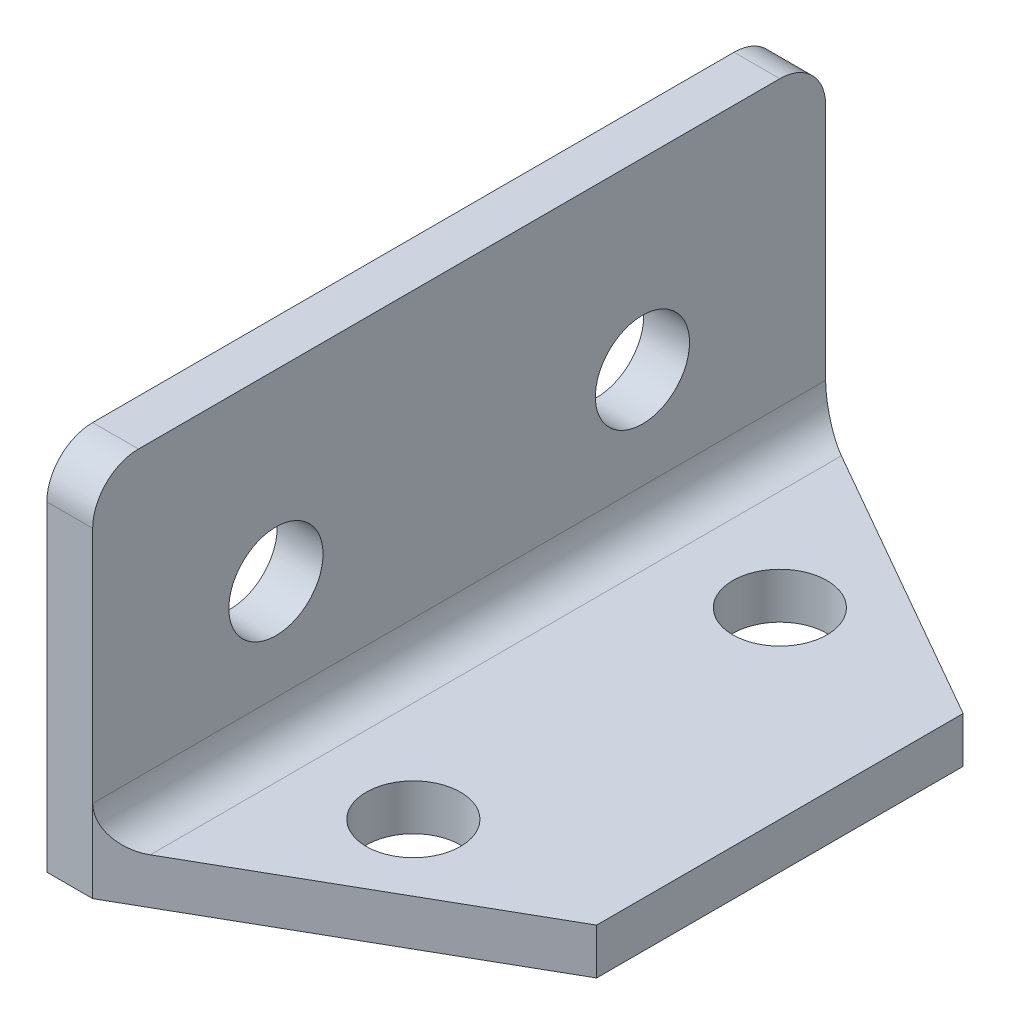
ISO-10303-21;
HEADER;
FILE_DESCRIPTION(('STEP AP214'),'2;1');
FILE_NAME('part.step','',(''),(''),'','','');
FILE_SCHEMA(('AUTOMOTIVE_DESIGN { 1 0 10303 214 1 1 1 1 }'));
ENDSEC;
DATA;
#1=APPLICATION_CONTEXT('core data for automotive mechanical design processes');
#2=APPLICATION_PROTOCOL_DEFINITION('international standard','automotive_design',2000,#1);
#3=PRODUCT_CONTEXT('',#1,'mechanical');
#4=PRODUCT('Part','Part','',(#3));
#5=PRODUCT_RELATED_PRODUCT_CATEGORY('part','',(#4));
#6=PRODUCT_DEFINITION_FORMATION('','',#4);
#7=PRODUCT_DEFINITION_CONTEXT('part definition',#1,'design');
#8=PRODUCT_DEFINITION('design','',#6,#7);
#9=PRODUCT_DEFINITION_SHAPE('','',#8);
#10=(LENGTH_UNIT() NAMED_UNIT(*) SI_UNIT(.MILLI.,.METRE.));
#11=(NAMED_UNIT(*) PLANE_ANGLE_UNIT() SI_UNIT($,.RADIAN.));
#12=(NAMED_UNIT(*) SI_UNIT($,.STERADIAN.) SOLID_ANGLE_UNIT());
#13=UNCERTAINTY_MEASURE_WITH_UNIT(LENGTH_MEASURE(1.E-05),#10,'distance_accuracy_value','');
#14=(GEOMETRIC_REPRESENTATION_CONTEXT(3) GLOBAL_UNCERTAINTY_ASSIGNED_CONTEXT((#13)) GLOBAL_UNIT_ASSIGNED_CONTEXT((#10,
#11,#12)) REPRESENTATION_CONTEXT('',''));
#15=CARTESIAN_POINT('',(0.,0.,0.));
#16=DIRECTION('',(0.,0.,1.));
#17=DIRECTION('',(1.,0.,0.));
#18=AXIS2_PLACEMENT_3D('',#15,#16,#17);
#19=CARTESIAN_POINT('',(0.,3.175,0.));
#20=DIRECTION('',(0.,-1.,0.));
#21=DIRECTION('',(0.,0.,-1.));
#22=AXIS2_PLACEMENT_3D('',#19,#20,#21);
#23=PLANE('',#22);
#24=CARTESIAN_POINT('',(12.7,3.175,-12.7));
#25=DIRECTION('',(0.,1.,0.));
#26=DIRECTION('',(0.,0.,1.));
#27=AXIS2_PLACEMENT_3D('',#24,#25,#26);
#28=CIRCLE('',#27,3.2639);
#29=CARTESIAN_POINT('',(12.7,3.175,-9.4361));
#30=VERTEX_POINT('',#29);
#31=EDGE_CURVE('E204',#30,#30,#28,.T.);
#32=ORIENTED_EDGE('',*,*,#31,.F.);
#33=EDGE_LOOP('',(#32));
#34=FACE_BOUND('',#33,.T.);
#35=CARTESIAN_POINT('',(12.7,3.175,-38.1));
#36=DIRECTION('',(0.,1.,0.));
#37=DIRECTION('',(0.,0.,1.));
#38=AXIS2_PLACEMENT_3D('',#35,#36,#37);
#39=CIRCLE('',#38,3.2639);
#40=CARTESIAN_POINT('',(12.7,3.175,-34.8361));
#41=VERTEX_POINT('',#40);
#42=EDGE_CURVE('E210',#41,#41,#39,.T.);
#43=ORIENTED_EDGE('',*,*,#42,.F.);
#44=EDGE_LOOP('',(#43));
#45=FACE_BOUND('',#44,.T.);
#46=DIRECTION('',(0.,0.,-1.));
#47=VECTOR('',#46,1.);
#48=CARTESIAN_POINT('',(5.715,3.175,0.));
#49=LINE('',#48,#47);
#50=CARTESIAN_POINT('',(5.715,3.175,-49.3485714285714));
#51=VERTEX_POINT('',#50);
#52=CARTESIAN_POINT('',(5.715,3.175,-1.45142857142857));
#53=VERTEX_POINT('',#52);
#54=EDGE_CURVE('E156',#51,#53,#49,.F.);
#55=ORIENTED_EDGE('',*,*,#54,.T.);
#56=DIRECTION('',(0.868243142124459,0.,-0.496138938356834));
#57=VECTOR('',#56,1.);
#58=CARTESIAN_POINT('',(0.781538461538463,3.175,1.36769230769231));
#59=LINE('',#58,#57);
#60=CARTESIAN_POINT('',(25.4,3.175,-12.7));
#61=VERTEX_POINT('',#60);
#62=EDGE_CURVE('E268',#53,#61,#59,.T.);
#63=ORIENTED_EDGE('',*,*,#62,.T.);
#64=DIRECTION('',(0.,0.,-1.));
#65=VECTOR('',#64,1.);
#66=CARTESIAN_POINT('',(25.4,3.175,0.));
#67=LINE('',#66,#65);
#68=CARTESIAN_POINT('',(25.4,3.175,-38.1));
#69=VERTEX_POINT('',#68);
#70=EDGE_CURVE('E133',#61,#69,#67,.T.);
#71=ORIENTED_EDGE('',*,*,#70,.T.);
#72=DIRECTION('',(-0.868243142124459,0.,-0.496138938356834));
#73=VECTOR('',#72,1.);
#74=CARTESIAN_POINT('',(22.6646153846154,3.175,-39.6630769230769));
#75=LINE('',#74,#73);
#76=EDGE_CURVE('E271',#69,#51,#75,.T.);
#77=ORIENTED_EDGE('',*,*,#76,.T.);
#78=EDGE_LOOP('',(#55,#63,#71,#77));
#79=FACE_BOUND('',#78,.T.);
#80=ADVANCED_FACE('F38',(#34,#45,#79),#23,.F.);
#81=CARTESIAN_POINT('',(0.,0.,0.));
#82=DIRECTION('',(0.,-1.,0.));
#83=DIRECTION('',(0.,0.,-1.));
#84=AXIS2_PLACEMENT_3D('',#81,#82,#83);
#85=PLANE('',#84);
#86=DIRECTION('',(-0.868243142124459,0.,0.496138938356834));
#87=VECTOR('',#86,1.);
#88=CARTESIAN_POINT('',(3.175,0.,0.));
#89=LINE('',#88,#87);
#90=CARTESIAN_POINT('',(25.4,0.,-12.7));
#91=VERTEX_POINT('',#90);
#92=CARTESIAN_POINT('',(3.175,0.,0.));
#93=VERTEX_POINT('',#92);
#94=EDGE_CURVE('E112',#91,#93,#89,.T.);
#95=ORIENTED_EDGE('',*,*,#94,.T.);
#96=DIRECTION('',(1.,0.,0.));
#97=VECTOR('',#96,1.);
#98=CARTESIAN_POINT('',(0.,0.,0.));
#99=LINE('',#98,#97);
#100=CARTESIAN_POINT('',(0.,0.,0.));
#101=VERTEX_POINT('',#100);
#102=EDGE_CURVE('E141',#101,#93,#99,.T.);
#103=ORIENTED_EDGE('',*,*,#102,.F.);
#104=DIRECTION('',(0.,0.,1.));
#105=VECTOR('',#104,1.);
#106=CARTESIAN_POINT('',(0.,0.,0.));
#107=LINE('',#106,#105);
#108=CARTESIAN_POINT('',(0.,0.,-50.8));
#109=VERTEX_POINT('',#108);
#110=EDGE_CURVE('E145',#109,#101,#107,.T.);
#111=ORIENTED_EDGE('',*,*,#110,.F.);
#112=DIRECTION('',(-1.,0.,0.));
#113=VECTOR('',#112,1.);
#114=CARTESIAN_POINT('',(0.,0.,-50.8));
#115=LINE('',#114,#113);
#116=CARTESIAN_POINT('',(3.175,0.,-50.8));
#117=VERTEX_POINT('',#116);
#118=EDGE_CURVE('E140',#117,#109,#115,.T.);
#119=ORIENTED_EDGE('',*,*,#118,.F.);
#120=DIRECTION('',(0.868243142124459,0.,0.496138938356834));
#121=VECTOR('',#120,1.);
#122=CARTESIAN_POINT('',(3.175,0.,-50.8));
#123=LINE('',#122,#121);
#124=CARTESIAN_POINT('',(25.4,0.,-38.1));
#125=VERTEX_POINT('',#124);
#126=EDGE_CURVE('E139',#117,#125,#123,.T.);
#127=ORIENTED_EDGE('',*,*,#126,.T.);
#128=DIRECTION('',(0.,0.,-1.));
#129=VECTOR('',#128,1.);
#130=CARTESIAN_POINT('',(25.4,0.,0.));
#131=LINE('',#130,#129);
#132=EDGE_CURVE('E131',#91,#125,#131,.T.);
#133=ORIENTED_EDGE('',*,*,#132,.F.);
#134=EDGE_LOOP('',(#95,#103,#111,#119,#127,#133));
#135=FACE_BOUND('',#134,.T.);
#136=CARTESIAN_POINT('',(12.7,0.,-38.1));
#137=DIRECTION('',(0.,1.,0.));
#138=DIRECTION('',(0.,0.,1.));
#139=AXIS2_PLACEMENT_3D('',#136,#137,#138);
#140=CIRCLE('',#139,3.2639);
#141=CARTESIAN_POINT('',(12.7,0.,-34.8361));
#142=VERTEX_POINT('',#141);
#143=EDGE_CURVE('E207',#142,#142,#140,.T.);
#144=ORIENTED_EDGE('',*,*,#143,.T.);
#145=EDGE_LOOP('',(#144));
#146=FACE_BOUND('',#145,.T.);
#147=CARTESIAN_POINT('',(12.7,0.,-12.7));
#148=DIRECTION('',(0.,1.,0.));
#149=DIRECTION('',(0.,0.,1.));
#150=AXIS2_PLACEMENT_3D('',#147,#148,#149);
#151=CIRCLE('',#150,3.2639);
#152=CARTESIAN_POINT('',(12.7,0.,-9.4361));
#153=VERTEX_POINT('',#152);
#154=EDGE_CURVE('E203',#153,#153,#151,.T.);
#155=ORIENTED_EDGE('',*,*,#154,.T.);
#156=EDGE_LOOP('',(#155));
#157=FACE_BOUND('',#156,.T.);
#158=ADVANCED_FACE('F136',(#135,#146,#157),#85,.T.);
#159=CARTESIAN_POINT('',(0.,3.175,0.));
#160=DIRECTION('',(1.,0.,0.));
#161=DIRECTION('',(0.,0.,-1.));
#162=AXIS2_PLACEMENT_3D('',#159,#160,#161);
#163=PLANE('',#162);
#164=CARTESIAN_POINT('',(0.,12.7,-12.7));
#165=DIRECTION('',(1.,0.,0.));
#166=DIRECTION('',(0.,0.,-1.));
#167=AXIS2_PLACEMENT_3D('',#164,#165,#166);
#168=CIRCLE('',#167,3.2639);
#169=CARTESIAN_POINT('',(0.,12.7,-15.9639));
#170=VERTEX_POINT('',#169);
#171=EDGE_CURVE('E191',#170,#170,#168,.T.);
#172=ORIENTED_EDGE('',*,*,#171,.T.);
#173=EDGE_LOOP('',(#172));
#174=FACE_BOUND('',#173,.T.);
#175=CARTESIAN_POINT('',(0.,12.7,-38.1));
#176=DIRECTION('',(1.,0.,0.));
#177=DIRECTION('',(0.,0.,-1.));
#178=AXIS2_PLACEMENT_3D('',#175,#176,#177);
#179=CIRCLE('',#178,3.2639);
#180=CARTESIAN_POINT('',(0.,12.7,-41.3639));
#181=VERTEX_POINT('',#180);
#182=EDGE_CURVE('E196',#181,#181,#179,.T.);
#183=ORIENTED_EDGE('',*,*,#182,.T.);
#184=EDGE_LOOP('',(#183));
#185=FACE_BOUND('',#184,.T.);
#186=DIRECTION('',(0.,0.,1.));
#187=VECTOR('',#186,1.);
#188=CARTESIAN_POINT('',(0.,25.4,0.));
#189=LINE('',#188,#187);
#190=CARTESIAN_POINT('',(0.,25.4,-47.625));
#191=VERTEX_POINT('',#190);
#192=CARTESIAN_POINT('',(0.,25.4,-3.175));
#193=VERTEX_POINT('',#192);
#194=EDGE_CURVE('E182',#191,#193,#189,.T.);
#195=ORIENTED_EDGE('',*,*,#194,.F.);
#196=CARTESIAN_POINT('',(0.,22.225,-47.625));
#197=DIRECTION('',(1.,0.,0.));
#198=DIRECTION('',(0.,0.,-1.));
#199=AXIS2_PLACEMENT_3D('',#196,#197,#198);
#200=CIRCLE('',#199,3.175);
#201=CARTESIAN_POINT('',(0.,22.225,-50.8));
#202=VERTEX_POINT('',#201);
#203=EDGE_CURVE('E60',#191,#202,#200,.F.);
#204=ORIENTED_EDGE('',*,*,#203,.T.);
#205=DIRECTION('',(0.,-1.,0.));
#206=VECTOR('',#205,1.);
#207=CARTESIAN_POINT('',(0.,3.175,-50.8));
#208=LINE('',#207,#206);
#209=EDGE_CURVE('E149',#202,#109,#208,.T.);
#210=ORIENTED_EDGE('',*,*,#209,.T.);
#211=ORIENTED_EDGE('',*,*,#110,.T.);
#212=DIRECTION('',(0.,-1.,0.));
#213=VECTOR('',#212,1.);
#214=CARTESIAN_POINT('',(0.,3.175,0.));
#215=LINE('',#214,#213);
#216=CARTESIAN_POINT('',(0.,22.225,0.));
#217=VERTEX_POINT('',#216);
#218=EDGE_CURVE('E151',#217,#101,#215,.T.);
#219=ORIENTED_EDGE('',*,*,#218,.F.);
#220=CARTESIAN_POINT('',(0.,22.225,-3.175));
#221=DIRECTION('',(1.,0.,0.));
#222=DIRECTION('',(0.,0.,-1.));
#223=AXIS2_PLACEMENT_3D('',#220,#221,#222);
#224=CIRCLE('',#223,3.175);
#225=EDGE_CURVE('E172',#217,#193,#224,.F.);
#226=ORIENTED_EDGE('',*,*,#225,.T.);
#227=EDGE_LOOP('',(#195,#204,#210,#211,#219,#226));
#228=FACE_BOUND('',#227,.T.);
#229=ADVANCED_FACE('F187',(#174,#185,#228),#163,.F.);
#230=CARTESIAN_POINT('',(0.,3.175,0.));
#231=DIRECTION('',(0.,0.,-1.));
#232=DIRECTION('',(-1.,0.,0.));
#233=AXIS2_PLACEMENT_3D('',#230,#231,#232);
#234=PLANE('',#233);
#235=DIRECTION('',(0.,-1.,0.));
#236=VECTOR('',#235,1.);
#237=CARTESIAN_POINT('',(3.175,25.4,0.));
#238=LINE('',#237,#236);
#239=CARTESIAN_POINT('',(3.175,22.225,0.));
#240=VERTEX_POINT('',#239);
#241=CARTESIAN_POINT('',(3.175,5.715,0.));
#242=VERTEX_POINT('',#241);
#243=EDGE_CURVE('E201',#240,#242,#238,.T.);
#244=ORIENTED_EDGE('',*,*,#243,.F.);
#245=DIRECTION('',(1.,0.,0.));
#246=VECTOR('',#245,1.);
#247=CARTESIAN_POINT('',(0.,22.225,0.));
#248=LINE('',#247,#246);
#249=EDGE_CURVE('E170',#240,#217,#248,.F.);
#250=ORIENTED_EDGE('',*,*,#249,.T.);
#251=ORIENTED_EDGE('',*,*,#218,.T.);
#252=ORIENTED_EDGE('',*,*,#102,.T.);
#253=DIRECTION('',(0.,1.,0.));
#254=VECTOR('',#253,1.);
#255=CARTESIAN_POINT('',(3.175,0.,0.));
#256=LINE('',#255,#254);
#257=EDGE_CURVE('E119',#93,#242,#256,.T.);
#258=ORIENTED_EDGE('',*,*,#257,.T.);
#259=EDGE_LOOP('',(#244,#250,#251,#252,#258));
#260=FACE_BOUND('',#259,.T.);
#261=ADVANCED_FACE('F219',(#260),#234,.F.);
#262=CARTESIAN_POINT('',(25.4,3.175,0.));
#263=DIRECTION('',(-1.,0.,0.));
#264=DIRECTION('',(0.,0.,1.));
#265=AXIS2_PLACEMENT_3D('',#262,#263,#264);
#266=PLANE('',#265);
#267=ORIENTED_EDGE('',*,*,#70,.F.);
#268=DIRECTION('',(0.,1.,0.));
#269=VECTOR('',#268,1.);
#270=CARTESIAN_POINT('',(25.4,0.,-12.7));
#271=LINE('',#270,#269);
#272=EDGE_CURVE('E116',#91,#61,#271,.T.);
#273=ORIENTED_EDGE('',*,*,#272,.F.);
#274=ORIENTED_EDGE('',*,*,#132,.T.);
#275=DIRECTION('',(0.,1.,0.));
#276=VECTOR('',#275,1.);
#277=CARTESIAN_POINT('',(25.4,0.,-38.1));
#278=LINE('',#277,#276);
#279=EDGE_CURVE('E124',#125,#69,#278,.T.);
#280=ORIENTED_EDGE('',*,*,#279,.T.);
#281=EDGE_LOOP('',(#267,#273,#274,#280));
#282=FACE_BOUND('',#281,.T.);
#283=ADVANCED_FACE('F129',(#282),#266,.F.);
#284=CARTESIAN_POINT('',(0.,3.175,-50.8));
#285=DIRECTION('',(0.,0.,1.));
#286=DIRECTION('',(1.,0.,0.));
#287=AXIS2_PLACEMENT_3D('',#284,#285,#286);
#288=PLANE('',#287);
#289=ORIENTED_EDGE('',*,*,#209,.F.);
#290=DIRECTION('',(-1.,0.,0.));
#291=VECTOR('',#290,1.);
#292=CARTESIAN_POINT('',(0.,22.225,-50.8));
#293=LINE('',#292,#291);
#294=CARTESIAN_POINT('',(3.175,22.225,-50.8));
#295=VERTEX_POINT('',#294);
#296=EDGE_CURVE('E46',#202,#295,#293,.F.);
#297=ORIENTED_EDGE('',*,*,#296,.T.);
#298=DIRECTION('',(0.,-1.,0.));
#299=VECTOR('',#298,1.);
#300=CARTESIAN_POINT('',(3.175,25.4,-50.8));
#301=LINE('',#300,#299);
#302=CARTESIAN_POINT('',(3.175,5.715,-50.8));
#303=VERTEX_POINT('',#302);
#304=EDGE_CURVE('E193',#295,#303,#301,.T.);
#305=ORIENTED_EDGE('',*,*,#304,.T.);
#306=DIRECTION('',(0.,1.,0.));
#307=VECTOR('',#306,1.);
#308=CARTESIAN_POINT('',(3.175,0.,-50.8));
#309=LINE('',#308,#307);
#310=EDGE_CURVE('E311',#117,#303,#309,.T.);
#311=ORIENTED_EDGE('',*,*,#310,.F.);
#312=ORIENTED_EDGE('',*,*,#118,.T.);
#313=EDGE_LOOP('',(#289,#297,#305,#311,#312));
#314=FACE_BOUND('',#313,.T.);
#315=ADVANCED_FACE('F243',(#314),#288,.F.);
#316=CARTESIAN_POINT('',(12.7,3.175,-38.1));
#317=DIRECTION('',(0.,-1.,0.));
#318=DIRECTION('',(0.,0.,-1.));
#319=AXIS2_PLACEMENT_3D('',#316,#317,#318);
#320=CYLINDRICAL_SURFACE('',#319,3.2639);
#321=ORIENTED_EDGE('',*,*,#42,.T.);
#322=EDGE_LOOP('',(#321));
#323=FACE_BOUND('',#322,.T.);
#324=ORIENTED_EDGE('',*,*,#143,.F.);
#325=EDGE_LOOP('',(#324));
#326=FACE_BOUND('',#325,.T.);
#327=ADVANCED_FACE('F240',(#323,#326),#320,.F.);
#328=CARTESIAN_POINT('',(12.7,3.175,-12.7));
#329=DIRECTION('',(0.,-1.,0.));
#330=DIRECTION('',(0.,0.,-1.));
#331=AXIS2_PLACEMENT_3D('',#328,#329,#330);
#332=CYLINDRICAL_SURFACE('',#331,3.2639);
#333=ORIENTED_EDGE('',*,*,#31,.T.);
#334=EDGE_LOOP('',(#333));
#335=FACE_BOUND('',#334,.T.);
#336=ORIENTED_EDGE('',*,*,#154,.F.);
#337=EDGE_LOOP('',(#336));
#338=FACE_BOUND('',#337,.T.);
#339=ADVANCED_FACE('F294',(#335,#338),#332,.F.);
#340=CARTESIAN_POINT('',(3.175,25.4,0.));
#341=DIRECTION('',(-1.,0.,0.));
#342=DIRECTION('',(0.,0.,1.));
#343=AXIS2_PLACEMENT_3D('',#340,#341,#342);
#344=PLANE('',#343);
#345=CARTESIAN_POINT('',(3.175,12.7,-12.7));
#346=DIRECTION('',(1.,0.,0.));
#347=DIRECTION('',(0.,0.,-1.));
#348=AXIS2_PLACEMENT_3D('',#345,#346,#347);
#349=CIRCLE('',#348,3.2639);
#350=CARTESIAN_POINT('',(3.175,12.7,-15.9639));
#351=VERTEX_POINT('',#350);
#352=EDGE_CURVE('E274',#351,#351,#349,.T.);
#353=ORIENTED_EDGE('',*,*,#352,.F.);
#354=EDGE_LOOP('',(#353));
#355=FACE_BOUND('',#354,.T.);
#356=CARTESIAN_POINT('',(3.175,12.7,-38.1));
#357=DIRECTION('',(1.,0.,0.));
#358=DIRECTION('',(0.,0.,-1.));
#359=AXIS2_PLACEMENT_3D('',#356,#357,#358);
#360=CIRCLE('',#359,3.2639);
#361=CARTESIAN_POINT('',(3.175,12.7,-41.3639));
#362=VERTEX_POINT('',#361);
#363=EDGE_CURVE('E270',#362,#362,#360,.T.);
#364=ORIENTED_EDGE('',*,*,#363,.F.);
#365=EDGE_LOOP('',(#364));
#366=FACE_BOUND('',#365,.T.);
#367=ORIENTED_EDGE('',*,*,#304,.F.);
#368=CARTESIAN_POINT('',(3.175,22.225,-47.625));
#369=DIRECTION('',(-1.,0.,0.));
#370=DIRECTION('',(0.,0.,1.));
#371=AXIS2_PLACEMENT_3D('',#368,#369,#370);
#372=CIRCLE('',#371,3.175);
#373=CARTESIAN_POINT('',(3.175,25.4,-47.625));
#374=VERTEX_POINT('',#373);
#375=EDGE_CURVE('E11',#295,#374,#372,.F.);
#376=ORIENTED_EDGE('',*,*,#375,.T.);
#377=DIRECTION('',(0.,0.,-1.));
#378=VECTOR('',#377,1.);
#379=CARTESIAN_POINT('',(3.175,25.4,0.));
#380=LINE('',#379,#378);
#381=CARTESIAN_POINT('',(3.175,25.4,-3.175));
#382=VERTEX_POINT('',#381);
#383=EDGE_CURVE('E184',#382,#374,#380,.T.);
#384=ORIENTED_EDGE('',*,*,#383,.F.);
#385=CARTESIAN_POINT('',(3.175,22.225,-3.175));
#386=DIRECTION('',(-1.,0.,0.));
#387=DIRECTION('',(0.,0.,1.));
#388=AXIS2_PLACEMENT_3D('',#385,#386,#387);
#389=CIRCLE('',#388,3.175);
#390=EDGE_CURVE('E168',#382,#240,#389,.F.);
#391=ORIENTED_EDGE('',*,*,#390,.T.);
#392=ORIENTED_EDGE('',*,*,#243,.T.);
#393=DIRECTION('',(0.,0.,-1.));
#394=VECTOR('',#393,1.);
#395=CARTESIAN_POINT('',(3.175,5.715,-50.8));
#396=LINE('',#395,#394);
#397=EDGE_CURVE('E153',#242,#303,#396,.T.);
#398=ORIENTED_EDGE('',*,*,#397,.T.);
#399=EDGE_LOOP('',(#367,#376,#384,#391,#392,#398));
#400=FACE_BOUND('',#399,.T.);
#401=ADVANCED_FACE('F225',(#355,#366,#400),#344,.F.);
#402=CARTESIAN_POINT('',(0.,25.4,0.));
#403=DIRECTION('',(0.,-1.,0.));
#404=DIRECTION('',(0.,0.,-1.));
#405=AXIS2_PLACEMENT_3D('',#402,#403,#404);
#406=PLANE('',#405);
#407=ORIENTED_EDGE('',*,*,#383,.T.);
#408=DIRECTION('',(-1.,0.,0.));
#409=VECTOR('',#408,1.);
#410=CARTESIAN_POINT('',(0.,25.4,-47.625));
#411=LINE('',#410,#409);
#412=EDGE_CURVE('E175',#374,#191,#411,.T.);
#413=ORIENTED_EDGE('',*,*,#412,.T.);
#414=ORIENTED_EDGE('',*,*,#194,.T.);
#415=DIRECTION('',(1.,0.,0.));
#416=VECTOR('',#415,1.);
#417=CARTESIAN_POINT('',(0.,25.4,-3.175));
#418=LINE('',#417,#416);
#419=EDGE_CURVE('E165',#193,#382,#418,.T.);
#420=ORIENTED_EDGE('',*,*,#419,.T.);
#421=EDGE_LOOP('',(#407,#413,#414,#420));
#422=FACE_BOUND('',#421,.T.);
#423=ADVANCED_FACE('F181',(#422),#406,.F.);
#424=CARTESIAN_POINT('',(-19.05,12.7,-38.1));
#425=DIRECTION('',(1.,0.,0.));
#426=DIRECTION('',(0.,0.,-1.));
#427=AXIS2_PLACEMENT_3D('',#424,#425,#426);
#428=CYLINDRICAL_SURFACE('',#427,3.2639);
#429=ORIENTED_EDGE('',*,*,#363,.T.);
#430=EDGE_LOOP('',(#429));
#431=FACE_BOUND('',#430,.T.);
#432=ORIENTED_EDGE('',*,*,#182,.F.);
#433=EDGE_LOOP('',(#432));
#434=FACE_BOUND('',#433,.T.);
#435=ADVANCED_FACE('F264',(#431,#434),#428,.F.);
#436=CARTESIAN_POINT('',(-19.05,12.7,-12.7));
#437=DIRECTION('',(1.,0.,0.));
#438=DIRECTION('',(0.,0.,-1.));
#439=AXIS2_PLACEMENT_3D('',#436,#437,#438);
#440=CYLINDRICAL_SURFACE('',#439,3.2639);
#441=ORIENTED_EDGE('',*,*,#352,.T.);
#442=EDGE_LOOP('',(#441));
#443=FACE_BOUND('',#442,.T.);
#444=ORIENTED_EDGE('',*,*,#171,.F.);
#445=EDGE_LOOP('',(#444));
#446=FACE_BOUND('',#445,.T.);
#447=ADVANCED_FACE('F256',(#443,#446),#440,.F.);
#448=CARTESIAN_POINT('',(5.715,5.715,0.));
#449=DIRECTION('',(0.,0.,1.));
#450=DIRECTION('',(1.,0.,0.));
#451=AXIS2_PLACEMENT_3D('',#448,#449,#450);
#452=CYLINDRICAL_SURFACE('',#451,2.54);
#453=ORIENTED_EDGE('',*,*,#397,.F.);
#454=CARTESIAN_POINT('',(5.715,5.715,-1.45142857142857));
#455=DIRECTION('',(-0.496138938356834,0.,-0.868243142124459));
#456=DIRECTION('',(-0.868243142124459,0.,0.496138938356834));
#457=AXIS2_PLACEMENT_3D('',#454,#455,#456);
#458=ELLIPSE('',#457,2.92544781152547,2.54);
#459=EDGE_CURVE('E162',#242,#53,#458,.F.);
#460=ORIENTED_EDGE('',*,*,#459,.T.);
#461=ORIENTED_EDGE('',*,*,#54,.F.);
#462=CARTESIAN_POINT('',(5.715,5.715,-49.3485714285714));
#463=DIRECTION('',(-0.496138938356834,0.,0.868243142124459));
#464=DIRECTION('',(0.868243142124459,0.,0.496138938356834));
#465=AXIS2_PLACEMENT_3D('',#462,#463,#464);
#466=ELLIPSE('',#465,2.92544781152547,2.54);
#467=EDGE_CURVE('E159',#51,#303,#466,.F.);
#468=ORIENTED_EDGE('',*,*,#467,.T.);
#469=EDGE_LOOP('',(#453,#460,#461,#468));
#470=FACE_BOUND('',#469,.T.);
#471=ADVANCED_FACE('F253',(#470),#452,.F.);
#472=CARTESIAN_POINT('',(3.175,0.,-50.8));
#473=DIRECTION('',(-0.496138938356834,0.,0.868243142124459));
#474=DIRECTION('',(0.868243142124459,0.,0.496138938356834));
#475=AXIS2_PLACEMENT_3D('',#472,#473,#474);
#476=PLANE('',#475);
#477=ORIENTED_EDGE('',*,*,#279,.F.);
#478=ORIENTED_EDGE('',*,*,#126,.F.);
#479=ORIENTED_EDGE('',*,*,#310,.T.);
#480=ORIENTED_EDGE('',*,*,#467,.F.);
#481=ORIENTED_EDGE('',*,*,#76,.F.);
#482=EDGE_LOOP('',(#477,#478,#479,#480,#481));
#483=FACE_BOUND('',#482,.T.);
#484=ADVANCED_FACE('F255',(#483),#476,.F.);
#485=CARTESIAN_POINT('',(3.175,0.,0.));
#486=DIRECTION('',(-0.496138938356834,0.,-0.868243142124459));
#487=DIRECTION('',(-0.868243142124459,0.,0.496138938356834));
#488=AXIS2_PLACEMENT_3D('',#485,#486,#487);
#489=PLANE('',#488);
#490=ORIENTED_EDGE('',*,*,#459,.F.);
#491=ORIENTED_EDGE('',*,*,#257,.F.);
#492=ORIENTED_EDGE('',*,*,#94,.F.);
#493=ORIENTED_EDGE('',*,*,#272,.T.);
#494=ORIENTED_EDGE('',*,*,#62,.F.);
#495=EDGE_LOOP('',(#490,#491,#492,#493,#494));
#496=FACE_BOUND('',#495,.T.);
#497=ADVANCED_FACE('F115',(#496),#489,.F.);
#498=CARTESIAN_POINT('',(0.,22.225,-3.175));
#499=DIRECTION('',(1.,0.,0.));
#500=DIRECTION('',(0.,0.,-1.));
#501=AXIS2_PLACEMENT_3D('',#498,#499,#500);
#502=CYLINDRICAL_SURFACE('',#501,3.175);
#503=ORIENTED_EDGE('',*,*,#225,.F.);
#504=ORIENTED_EDGE('',*,*,#249,.F.);
#505=ORIENTED_EDGE('',*,*,#390,.F.);
#506=ORIENTED_EDGE('',*,*,#419,.F.);
#507=EDGE_LOOP('',(#503,#504,#505,#506));
#508=FACE_BOUND('',#507,.T.);
#509=ADVANCED_FACE('F223',(#508),#502,.T.);
#510=CARTESIAN_POINT('',(0.,22.225,-47.625));
#511=DIRECTION('',(-1.,0.,0.));
#512=DIRECTION('',(0.,0.,1.));
#513=AXIS2_PLACEMENT_3D('',#510,#511,#512);
#514=CYLINDRICAL_SURFACE('',#513,3.175);
#515=ORIENTED_EDGE('',*,*,#375,.F.);
#516=ORIENTED_EDGE('',*,*,#296,.F.);
#517=ORIENTED_EDGE('',*,*,#203,.F.);
#518=ORIENTED_EDGE('',*,*,#412,.F.);
#519=EDGE_LOOP('',(#515,#516,#517,#518));
#520=FACE_BOUND('',#519,.T.);
#521=ADVANCED_FACE('F40',(#520),#514,.T.);
#522=CLOSED_SHELL('',(#80,#158,#229,#261,#283,#315,#327,#339,#401,#423,#435,#447,#471,#484,#497,
#509,#521));
#523=MANIFOLD_SOLID_BREP('B2',#522);
#524=ADVANCED_BREP_SHAPE_REPRESENTATION('',(#18,#523),#14);
#525=SHAPE_DEFINITION_REPRESENTATION(#9,#524);
ENDSEC;
END-ISO-10303-21;
